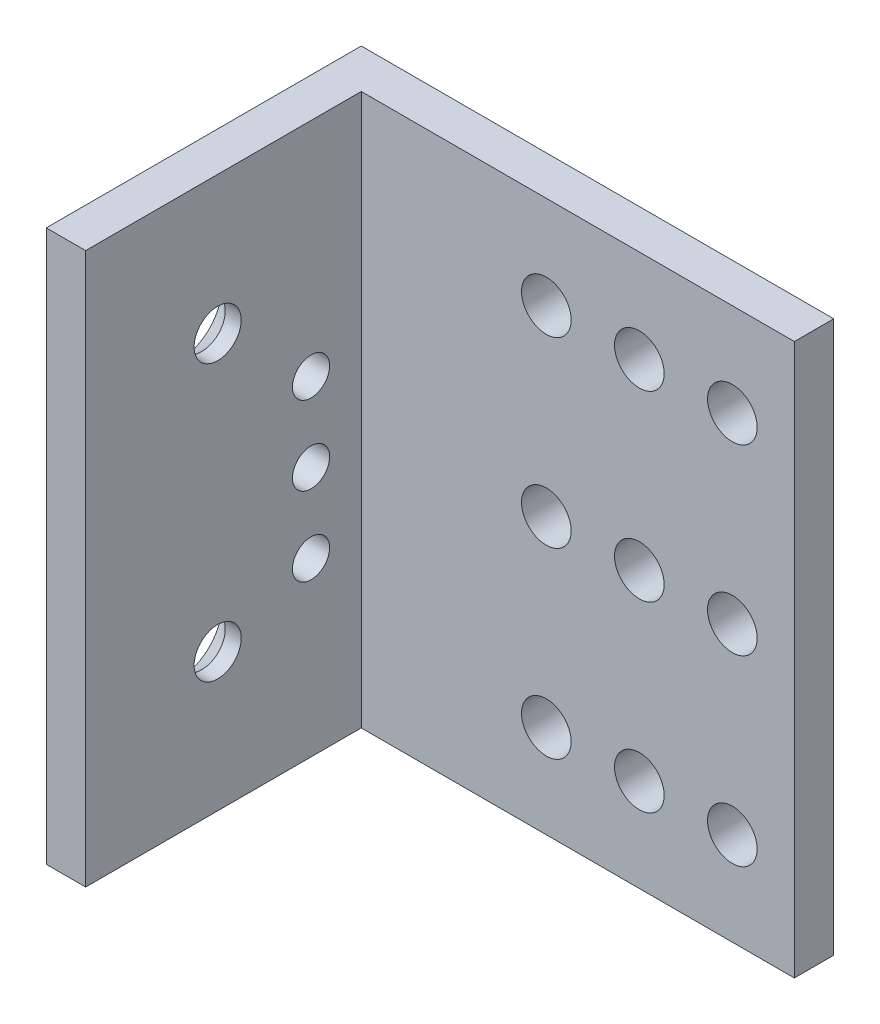
ISO-10303-21;
HEADER;
FILE_DESCRIPTION(('STEP AP214'),'2;1');
FILE_NAME('part.step','',(''),(''),'','','');
FILE_SCHEMA(('AUTOMOTIVE_DESIGN { 1 0 10303 214 1 1 1 1 }'));
ENDSEC;
DATA;
#1=APPLICATION_CONTEXT('core data for automotive mechanical design processes');
#2=APPLICATION_PROTOCOL_DEFINITION('international standard','automotive_design',2000,#1);
#3=PRODUCT_CONTEXT('',#1,'mechanical');
#4=PRODUCT('Part','Part','',(#3));
#5=PRODUCT_RELATED_PRODUCT_CATEGORY('part','',(#4));
#6=PRODUCT_DEFINITION_FORMATION('','',#4);
#7=PRODUCT_DEFINITION_CONTEXT('part definition',#1,'design');
#8=PRODUCT_DEFINITION('design','',#6,#7);
#9=PRODUCT_DEFINITION_SHAPE('','',#8);
#10=(LENGTH_UNIT() NAMED_UNIT(*) SI_UNIT(.MILLI.,.METRE.));
#11=(NAMED_UNIT(*) PLANE_ANGLE_UNIT() SI_UNIT($,.RADIAN.));
#12=(NAMED_UNIT(*) SI_UNIT($,.STERADIAN.) SOLID_ANGLE_UNIT());
#13=UNCERTAINTY_MEASURE_WITH_UNIT(LENGTH_MEASURE(1.E-05),#10,'distance_accuracy_value','');
#14=(GEOMETRIC_REPRESENTATION_CONTEXT(3) GLOBAL_UNCERTAINTY_ASSIGNED_CONTEXT((#13)) GLOBAL_UNIT_ASSIGNED_CONTEXT((#10,
#11,#12)) REPRESENTATION_CONTEXT('',''));
#15=CARTESIAN_POINT('',(0.,0.,0.));
#16=DIRECTION('',(0.,0.,1.));
#17=DIRECTION('',(1.,0.,0.));
#18=AXIS2_PLACEMENT_3D('',#15,#16,#17);
#19=CARTESIAN_POINT('',(19.05,22.225,-9.525));
#20=DIRECTION('',(-1.,0.,0.));
#21=DIRECTION('',(0.,0.,1.));
#22=AXIS2_PLACEMENT_3D('',#19,#20,#21);
#23=PLANE('',#22);
#24=DIRECTION('',(0.,0.,-1.));
#25=VECTOR('',#24,1.);
#26=CARTESIAN_POINT('',(19.05,-22.225,-9.525));
#27=LINE('',#26,#25);
#28=CARTESIAN_POINT('',(19.05,-22.225,-9.525));
#29=VERTEX_POINT('',#28);
#30=CARTESIAN_POINT('',(19.05,-22.225,-12.7));
#31=VERTEX_POINT('',#30);
#32=EDGE_CURVE('E129',#29,#31,#27,.T.);
#33=ORIENTED_EDGE('',*,*,#32,.T.);
#34=DIRECTION('',(0.,-1.,0.));
#35=VECTOR('',#34,1.);
#36=CARTESIAN_POINT('',(19.05,22.225,-12.7));
#37=LINE('',#36,#35);
#38=CARTESIAN_POINT('',(19.05,22.225,-12.7));
#39=VERTEX_POINT('',#38);
#40=EDGE_CURVE('E11',#39,#31,#37,.T.);
#41=ORIENTED_EDGE('',*,*,#40,.F.);
#42=DIRECTION('',(0.,0.,-1.));
#43=VECTOR('',#42,1.);
#44=CARTESIAN_POINT('',(19.05,22.225,-9.525));
#45=LINE('',#44,#43);
#46=CARTESIAN_POINT('',(19.05,22.225,-9.525));
#47=VERTEX_POINT('',#46);
#48=EDGE_CURVE('E146',#47,#39,#45,.T.);
#49=ORIENTED_EDGE('',*,*,#48,.F.);
#50=DIRECTION('',(0.,-1.,0.));
#51=VECTOR('',#50,1.);
#52=CARTESIAN_POINT('',(19.05,22.225,-9.525));
#53=LINE('',#52,#51);
#54=EDGE_CURVE('E125',#47,#29,#53,.T.);
#55=ORIENTED_EDGE('',*,*,#54,.T.);
#56=EDGE_LOOP('',(#33,#41,#49,#55));
#57=FACE_BOUND('',#56,.T.);
#58=ADVANCED_FACE('F38',(#57),#23,.F.);
#59=CARTESIAN_POINT('',(-19.05,22.225,-12.7));
#60=DIRECTION('',(0.,0.,1.));
#61=DIRECTION('',(1.,0.,0.));
#62=AXIS2_PLACEMENT_3D('',#59,#60,#61);
#63=PLANE('',#62);
#64=CARTESIAN_POINT('',(-0.95,-14.725,-12.7));
#65=DIRECTION('',(0.,0.,-1.));
#66=DIRECTION('',(-1.,0.,0.));
#67=AXIS2_PLACEMENT_3D('',#64,#65,#66);
#68=CIRCLE('',#67,2.);
#69=CARTESIAN_POINT('',(-2.95,-14.725,-12.7));
#70=VERTEX_POINT('',#69);
#71=EDGE_CURVE('E487',#70,#70,#68,.T.);
#72=ORIENTED_EDGE('',*,*,#71,.F.);
#73=EDGE_LOOP('',(#72));
#74=FACE_BOUND('',#73,.T.);
#75=CARTESIAN_POINT('',(6.55,-14.725,-12.7));
#76=DIRECTION('',(0.,0.,-1.));
#77=DIRECTION('',(-1.,0.,0.));
#78=AXIS2_PLACEMENT_3D('',#75,#76,#77);
#79=CIRCLE('',#78,2.);
#80=CARTESIAN_POINT('',(4.55,-14.725,-12.7));
#81=VERTEX_POINT('',#80);
#82=EDGE_CURVE('E491',#81,#81,#79,.T.);
#83=ORIENTED_EDGE('',*,*,#82,.F.);
#84=EDGE_LOOP('',(#83));
#85=FACE_BOUND('',#84,.T.);
#86=CARTESIAN_POINT('',(6.55,0.,-12.7));
#87=DIRECTION('',(0.,0.,-1.));
#88=DIRECTION('',(-1.,0.,0.));
#89=AXIS2_PLACEMENT_3D('',#86,#87,#88);
#90=CIRCLE('',#89,2.);
#91=CARTESIAN_POINT('',(4.55,0.,-12.7));
#92=VERTEX_POINT('',#91);
#93=EDGE_CURVE('E495',#92,#92,#90,.T.);
#94=ORIENTED_EDGE('',*,*,#93,.F.);
#95=EDGE_LOOP('',(#94));
#96=FACE_BOUND('',#95,.T.);
#97=CARTESIAN_POINT('',(6.55,14.725,-12.7));
#98=DIRECTION('',(0.,0.,-1.));
#99=DIRECTION('',(-1.,0.,0.));
#100=AXIS2_PLACEMENT_3D('',#97,#98,#99);
#101=CIRCLE('',#100,2.);
#102=CARTESIAN_POINT('',(4.55,14.725,-12.7));
#103=VERTEX_POINT('',#102);
#104=EDGE_CURVE('E474',#103,#103,#101,.T.);
#105=ORIENTED_EDGE('',*,*,#104,.F.);
#106=EDGE_LOOP('',(#105));
#107=FACE_BOUND('',#106,.T.);
#108=CARTESIAN_POINT('',(14.05,0.,-12.7));
#109=DIRECTION('',(0.,0.,-1.));
#110=DIRECTION('',(-1.,0.,0.));
#111=AXIS2_PLACEMENT_3D('',#108,#109,#110);
#112=CIRCLE('',#111,2.);
#113=CARTESIAN_POINT('',(12.05,0.,-12.7));
#114=VERTEX_POINT('',#113);
#115=EDGE_CURVE('E470',#114,#114,#112,.T.);
#116=ORIENTED_EDGE('',*,*,#115,.F.);
#117=EDGE_LOOP('',(#116));
#118=FACE_BOUND('',#117,.T.);
#119=CARTESIAN_POINT('',(14.05,14.725,-12.7));
#120=DIRECTION('',(0.,0.,-1.));
#121=DIRECTION('',(-1.,0.,0.));
#122=AXIS2_PLACEMENT_3D('',#119,#120,#121);
#123=CIRCLE('',#122,2.);
#124=CARTESIAN_POINT('',(12.05,14.725,-12.7));
#125=VERTEX_POINT('',#124);
#126=EDGE_CURVE('E475',#125,#125,#123,.T.);
#127=ORIENTED_EDGE('',*,*,#126,.F.);
#128=EDGE_LOOP('',(#127));
#129=FACE_BOUND('',#128,.T.);
#130=CARTESIAN_POINT('',(-0.95,0.,-12.7));
#131=DIRECTION('',(0.,0.,-1.));
#132=DIRECTION('',(-1.,0.,0.));
#133=AXIS2_PLACEMENT_3D('',#130,#131,#132);
#134=CIRCLE('',#133,2.);
#135=CARTESIAN_POINT('',(-2.95,0.,-12.7));
#136=VERTEX_POINT('',#135);
#137=EDGE_CURVE('E479',#136,#136,#134,.T.);
#138=ORIENTED_EDGE('',*,*,#137,.F.);
#139=EDGE_LOOP('',(#138));
#140=FACE_BOUND('',#139,.T.);
#141=CARTESIAN_POINT('',(-0.95,14.725,-12.7));
#142=DIRECTION('',(0.,0.,-1.));
#143=DIRECTION('',(-1.,0.,0.));
#144=AXIS2_PLACEMENT_3D('',#141,#142,#143);
#145=CIRCLE('',#144,2.);
#146=CARTESIAN_POINT('',(-2.95,14.725,-12.7));
#147=VERTEX_POINT('',#146);
#148=EDGE_CURVE('E483',#147,#147,#145,.T.);
#149=ORIENTED_EDGE('',*,*,#148,.F.);
#150=EDGE_LOOP('',(#149));
#151=FACE_BOUND('',#150,.T.);
#152=CARTESIAN_POINT('',(14.05,-14.725,-12.7));
#153=DIRECTION('',(0.,0.,-1.));
#154=DIRECTION('',(-1.,0.,0.));
#155=AXIS2_PLACEMENT_3D('',#152,#153,#154);
#156=CIRCLE('',#155,2.);
#157=CARTESIAN_POINT('',(12.05,-14.725,-12.7));
#158=VERTEX_POINT('',#157);
#159=EDGE_CURVE('E165',#158,#158,#156,.T.);
#160=ORIENTED_EDGE('',*,*,#159,.F.);
#161=EDGE_LOOP('',(#160));
#162=FACE_BOUND('',#161,.T.);
#163=DIRECTION('',(-1.,0.,0.));
#164=VECTOR('',#163,1.);
#165=CARTESIAN_POINT('',(-19.05,-22.225,-12.7));
#166=LINE('',#165,#164);
#167=CARTESIAN_POINT('',(-19.05,-22.225,-12.7));
#168=VERTEX_POINT('',#167);
#169=EDGE_CURVE('E133',#31,#168,#166,.T.);
#170=ORIENTED_EDGE('',*,*,#169,.T.);
#171=DIRECTION('',(0.,-1.,0.));
#172=VECTOR('',#171,1.);
#173=CARTESIAN_POINT('',(-19.05,22.225,-12.7));
#174=LINE('',#173,#172);
#175=CARTESIAN_POINT('',(-19.05,22.225,-12.7));
#176=VERTEX_POINT('',#175);
#177=EDGE_CURVE('E48',#176,#168,#174,.T.);
#178=ORIENTED_EDGE('',*,*,#177,.F.);
#179=DIRECTION('',(-1.,0.,0.));
#180=VECTOR('',#179,1.);
#181=CARTESIAN_POINT('',(-19.05,22.225,-12.7));
#182=LINE('',#181,#180);
#183=EDGE_CURVE('E94',#39,#176,#182,.T.);
#184=ORIENTED_EDGE('',*,*,#183,.F.);
#185=ORIENTED_EDGE('',*,*,#40,.T.);
#186=EDGE_LOOP('',(#170,#178,#184,#185));
#187=FACE_BOUND('',#186,.T.);
#188=ADVANCED_FACE('F215',(#74,#85,#96,#107,#118,#129,#140,#151,#162,#187),#63,.F.);
#189=CARTESIAN_POINT('',(-19.05,22.225,12.7));
#190=DIRECTION('',(1.,0.,0.));
#191=DIRECTION('',(0.,0.,-1.));
#192=AXIS2_PLACEMENT_3D('',#189,#190,#191);
#193=PLANE('',#192);
#194=CARTESIAN_POINT('',(-19.05,4.35,-5.475));
#195=DIRECTION('',(1.,0.,0.));
#196=DIRECTION('',(0.,0.,-1.));
#197=AXIS2_PLACEMENT_3D('',#194,#195,#196);
#198=CIRCLE('',#197,1.5);
#199=CARTESIAN_POINT('',(-19.05,4.35,-6.975));
#200=VERTEX_POINT('',#199);
#201=EDGE_CURVE('E442',#200,#200,#198,.T.);
#202=ORIENTED_EDGE('',*,*,#201,.T.);
#203=EDGE_LOOP('',(#202));
#204=FACE_BOUND('',#203,.T.);
#205=CARTESIAN_POINT('',(-19.05,-8.35,-5.475));
#206=DIRECTION('',(1.,0.,0.));
#207=DIRECTION('',(0.,0.,-1.));
#208=AXIS2_PLACEMENT_3D('',#205,#206,#207);
#209=CIRCLE('',#208,1.5);
#210=CARTESIAN_POINT('',(-19.05,-8.35,-6.975));
#211=VERTEX_POINT('',#210);
#212=EDGE_CURVE('E462',#211,#211,#209,.T.);
#213=ORIENTED_EDGE('',*,*,#212,.T.);
#214=EDGE_LOOP('',(#213));
#215=FACE_BOUND('',#214,.T.);
#216=CARTESIAN_POINT('',(-19.05,-2.,-5.475));
#217=DIRECTION('',(1.,0.,0.));
#218=DIRECTION('',(0.,0.,-1.));
#219=AXIS2_PLACEMENT_3D('',#216,#217,#218);
#220=CIRCLE('',#219,1.5);
#221=CARTESIAN_POINT('',(-19.05,-2.,-6.975));
#222=VERTEX_POINT('',#221);
#223=EDGE_CURVE('E453',#222,#222,#220,.T.);
#224=ORIENTED_EDGE('',*,*,#223,.T.);
#225=EDGE_LOOP('',(#224));
#226=FACE_BOUND('',#225,.T.);
#227=CARTESIAN_POINT('',(-19.05,-11.1125,2.05500000000001));
#228=DIRECTION('',(-1.,0.,0.));
#229=DIRECTION('',(0.,0.,1.));
#230=AXIS2_PLACEMENT_3D('',#227,#228,#229);
#231=CIRCLE('',#230,3.5433);
#232=CARTESIAN_POINT('',(-19.05,-11.1125,5.59830000000001));
#233=VERTEX_POINT('',#232);
#234=EDGE_CURVE('E457',#233,#233,#231,.T.);
#235=ORIENTED_EDGE('',*,*,#234,.F.);
#236=EDGE_LOOP('',(#235));
#237=FACE_BOUND('',#236,.T.);
#238=CARTESIAN_POINT('',(-19.05,11.1125,2.05500000000001));
#239=DIRECTION('',(-1.,0.,0.));
#240=DIRECTION('',(0.,0.,1.));
#241=AXIS2_PLACEMENT_3D('',#238,#239,#240);
#242=CIRCLE('',#241,3.5433);
#243=CARTESIAN_POINT('',(-19.05,11.1125,5.59830000000001));
#244=VERTEX_POINT('',#243);
#245=EDGE_CURVE('E195',#244,#244,#242,.T.);
#246=ORIENTED_EDGE('',*,*,#245,.F.);
#247=EDGE_LOOP('',(#246));
#248=FACE_BOUND('',#247,.T.);
#249=DIRECTION('',(0.,0.,1.));
#250=VECTOR('',#249,1.);
#251=CARTESIAN_POINT('',(-19.05,-22.225,12.7));
#252=LINE('',#251,#250);
#253=CARTESIAN_POINT('',(-19.05,-22.225,12.7));
#254=VERTEX_POINT('',#253);
#255=EDGE_CURVE('E137',#168,#254,#252,.T.);
#256=ORIENTED_EDGE('',*,*,#255,.T.);
#257=DIRECTION('',(0.,-1.,0.));
#258=VECTOR('',#257,1.);
#259=CARTESIAN_POINT('',(-19.05,22.225,12.7));
#260=LINE('',#259,#258);
#261=CARTESIAN_POINT('',(-19.05,22.225,12.7));
#262=VERTEX_POINT('',#261);
#263=EDGE_CURVE('E118',#262,#254,#260,.T.);
#264=ORIENTED_EDGE('',*,*,#263,.F.);
#265=DIRECTION('',(0.,0.,1.));
#266=VECTOR('',#265,1.);
#267=CARTESIAN_POINT('',(-19.05,22.225,12.7));
#268=LINE('',#267,#266);
#269=EDGE_CURVE('E107',#176,#262,#268,.T.);
#270=ORIENTED_EDGE('',*,*,#269,.F.);
#271=ORIENTED_EDGE('',*,*,#177,.T.);
#272=EDGE_LOOP('',(#256,#264,#270,#271));
#273=FACE_BOUND('',#272,.T.);
#274=ADVANCED_FACE('F218',(#204,#215,#226,#237,#248,#273),#193,.F.);
#275=CARTESIAN_POINT('',(-19.05,22.225,12.7));
#276=DIRECTION('',(0.,0.,-1.));
#277=DIRECTION('',(-1.,0.,0.));
#278=AXIS2_PLACEMENT_3D('',#275,#276,#277);
#279=PLANE('',#278);
#280=DIRECTION('',(1.,0.,0.));
#281=VECTOR('',#280,1.);
#282=CARTESIAN_POINT('',(-19.05,-22.225,12.7));
#283=LINE('',#282,#281);
#284=CARTESIAN_POINT('',(-15.875,-22.225,12.7));
#285=VERTEX_POINT('',#284);
#286=EDGE_CURVE('E116',#254,#285,#283,.T.);
#287=ORIENTED_EDGE('',*,*,#286,.T.);
#288=DIRECTION('',(0.,-1.,0.));
#289=VECTOR('',#288,1.);
#290=CARTESIAN_POINT('',(-15.875,22.225,12.7));
#291=LINE('',#290,#289);
#292=CARTESIAN_POINT('',(-15.875,22.225,12.7));
#293=VERTEX_POINT('',#292);
#294=EDGE_CURVE('E113',#293,#285,#291,.T.);
#295=ORIENTED_EDGE('',*,*,#294,.F.);
#296=DIRECTION('',(1.,0.,0.));
#297=VECTOR('',#296,1.);
#298=CARTESIAN_POINT('',(-19.05,22.225,12.7));
#299=LINE('',#298,#297);
#300=EDGE_CURVE('E101',#262,#293,#299,.T.);
#301=ORIENTED_EDGE('',*,*,#300,.F.);
#302=ORIENTED_EDGE('',*,*,#263,.T.);
#303=EDGE_LOOP('',(#287,#295,#301,#302));
#304=FACE_BOUND('',#303,.T.);
#305=ADVANCED_FACE('F114',(#304),#279,.F.);
#306=CARTESIAN_POINT('',(-15.875,22.225,12.7));
#307=DIRECTION('',(-1.,0.,0.));
#308=DIRECTION('',(0.,0.,1.));
#309=AXIS2_PLACEMENT_3D('',#306,#307,#308);
#310=PLANE('',#309);
#311=CARTESIAN_POINT('',(-15.875,4.35,-5.475));
#312=DIRECTION('',(1.,0.,0.));
#313=DIRECTION('',(0.,0.,-1.));
#314=AXIS2_PLACEMENT_3D('',#311,#312,#313);
#315=CIRCLE('',#314,1.5);
#316=CARTESIAN_POINT('',(-15.875,4.35,-6.975));
#317=VERTEX_POINT('',#316);
#318=EDGE_CURVE('E445',#317,#317,#315,.T.);
#319=ORIENTED_EDGE('',*,*,#318,.F.);
#320=EDGE_LOOP('',(#319));
#321=FACE_BOUND('',#320,.T.);
#322=CARTESIAN_POINT('',(-15.875,-8.35,-5.475));
#323=DIRECTION('',(1.,0.,0.));
#324=DIRECTION('',(0.,0.,-1.));
#325=AXIS2_PLACEMENT_3D('',#322,#323,#324);
#326=CIRCLE('',#325,1.5);
#327=CARTESIAN_POINT('',(-15.875,-8.35,-6.975));
#328=VERTEX_POINT('',#327);
#329=EDGE_CURVE('E449',#328,#328,#326,.T.);
#330=ORIENTED_EDGE('',*,*,#329,.F.);
#331=EDGE_LOOP('',(#330));
#332=FACE_BOUND('',#331,.T.);
#333=CARTESIAN_POINT('',(-15.875,-2.,-5.475));
#334=DIRECTION('',(1.,0.,0.));
#335=DIRECTION('',(0.,0.,-1.));
#336=AXIS2_PLACEMENT_3D('',#333,#334,#335);
#337=CIRCLE('',#336,1.5);
#338=CARTESIAN_POINT('',(-15.875,-2.,-6.975));
#339=VERTEX_POINT('',#338);
#340=EDGE_CURVE('E458',#339,#339,#337,.T.);
#341=ORIENTED_EDGE('',*,*,#340,.F.);
#342=EDGE_LOOP('',(#341));
#343=FACE_BOUND('',#342,.T.);
#344=CARTESIAN_POINT('',(-15.875,-11.1125,2.05500000000001));
#345=DIRECTION('',(-1.,0.,0.));
#346=DIRECTION('',(0.,0.,1.));
#347=AXIS2_PLACEMENT_3D('',#344,#345,#346);
#348=CIRCLE('',#347,1.89864999999999);
#349=CARTESIAN_POINT('',(-15.875,-11.1125,3.95365));
#350=VERTEX_POINT('',#349);
#351=EDGE_CURVE('E41',#350,#350,#348,.T.);
#352=ORIENTED_EDGE('',*,*,#351,.T.);
#353=EDGE_LOOP('',(#352));
#354=FACE_BOUND('',#353,.T.);
#355=CARTESIAN_POINT('',(-15.875,11.1125,2.05500000000001));
#356=DIRECTION('',(-1.,0.,0.));
#357=DIRECTION('',(0.,0.,1.));
#358=AXIS2_PLACEMENT_3D('',#355,#356,#357);
#359=CIRCLE('',#358,1.89864999999999);
#360=CARTESIAN_POINT('',(-15.875,11.1125,3.95365));
#361=VERTEX_POINT('',#360);
#362=EDGE_CURVE('E134',#361,#361,#359,.T.);
#363=ORIENTED_EDGE('',*,*,#362,.T.);
#364=EDGE_LOOP('',(#363));
#365=FACE_BOUND('',#364,.T.);
#366=DIRECTION('',(0.,0.,-1.));
#367=VECTOR('',#366,1.);
#368=CARTESIAN_POINT('',(-15.875,-22.225,12.7));
#369=LINE('',#368,#367);
#370=CARTESIAN_POINT('',(-15.875,-22.225,-9.525));
#371=VERTEX_POINT('',#370);
#372=EDGE_CURVE('E80',#285,#371,#369,.T.);
#373=ORIENTED_EDGE('',*,*,#372,.T.);
#374=DIRECTION('',(0.,-1.,0.));
#375=VECTOR('',#374,1.);
#376=CARTESIAN_POINT('',(-15.875,22.225,-9.525));
#377=LINE('',#376,#375);
#378=CARTESIAN_POINT('',(-15.875,22.225,-9.525));
#379=VERTEX_POINT('',#378);
#380=EDGE_CURVE('E119',#379,#371,#377,.T.);
#381=ORIENTED_EDGE('',*,*,#380,.F.);
#382=DIRECTION('',(0.,0.,-1.));
#383=VECTOR('',#382,1.);
#384=CARTESIAN_POINT('',(-15.875,22.225,12.7));
#385=LINE('',#384,#383);
#386=EDGE_CURVE('E105',#293,#379,#385,.T.);
#387=ORIENTED_EDGE('',*,*,#386,.F.);
#388=ORIENTED_EDGE('',*,*,#294,.T.);
#389=EDGE_LOOP('',(#373,#381,#387,#388));
#390=FACE_BOUND('',#389,.T.);
#391=ADVANCED_FACE('F121',(#321,#332,#343,#354,#365,#390),#310,.F.);
#392=CARTESIAN_POINT('',(-15.875,22.225,-9.525));
#393=DIRECTION('',(0.,0.,-1.));
#394=DIRECTION('',(-1.,0.,0.));
#395=AXIS2_PLACEMENT_3D('',#392,#393,#394);
#396=PLANE('',#395);
#397=CARTESIAN_POINT('',(-0.95,-14.725,-9.52499999999999));
#398=DIRECTION('',(0.,0.,-1.));
#399=DIRECTION('',(-1.,0.,0.));
#400=AXIS2_PLACEMENT_3D('',#397,#398,#399);
#401=CIRCLE('',#400,2.);
#402=CARTESIAN_POINT('',(-2.95,-14.725,-9.52499999999999));
#403=VERTEX_POINT('',#402);
#404=EDGE_CURVE('E192',#403,#403,#401,.T.);
#405=ORIENTED_EDGE('',*,*,#404,.T.);
#406=EDGE_LOOP('',(#405));
#407=FACE_BOUND('',#406,.T.);
#408=CARTESIAN_POINT('',(6.55,-14.725,-9.52499999999999));
#409=DIRECTION('',(0.,0.,-1.));
#410=DIRECTION('',(-1.,0.,0.));
#411=AXIS2_PLACEMENT_3D('',#408,#409,#410);
#412=CIRCLE('',#411,2.);
#413=CARTESIAN_POINT('',(4.55,-14.725,-9.52499999999999));
#414=VERTEX_POINT('',#413);
#415=EDGE_CURVE('E189',#414,#414,#412,.T.);
#416=ORIENTED_EDGE('',*,*,#415,.T.);
#417=EDGE_LOOP('',(#416));
#418=FACE_BOUND('',#417,.T.);
#419=CARTESIAN_POINT('',(6.55,0.,-9.52499999999999));
#420=DIRECTION('',(0.,0.,-1.));
#421=DIRECTION('',(-1.,0.,0.));
#422=AXIS2_PLACEMENT_3D('',#419,#420,#421);
#423=CIRCLE('',#422,2.);
#424=CARTESIAN_POINT('',(4.55,0.,-9.52499999999999));
#425=VERTEX_POINT('',#424);
#426=EDGE_CURVE('E185',#425,#425,#423,.T.);
#427=ORIENTED_EDGE('',*,*,#426,.T.);
#428=EDGE_LOOP('',(#427));
#429=FACE_BOUND('',#428,.T.);
#430=CARTESIAN_POINT('',(6.55,14.725,-9.52499999999999));
#431=DIRECTION('',(0.,0.,-1.));
#432=DIRECTION('',(-1.,0.,0.));
#433=AXIS2_PLACEMENT_3D('',#430,#431,#432);
#434=CIRCLE('',#433,2.);
#435=CARTESIAN_POINT('',(4.55,14.725,-9.52499999999999));
#436=VERTEX_POINT('',#435);
#437=EDGE_CURVE('E181',#436,#436,#434,.T.);
#438=ORIENTED_EDGE('',*,*,#437,.T.);
#439=EDGE_LOOP('',(#438));
#440=FACE_BOUND('',#439,.T.);
#441=CARTESIAN_POINT('',(14.05,0.,-9.52499999999999));
#442=DIRECTION('',(0.,0.,-1.));
#443=DIRECTION('',(-1.,0.,0.));
#444=AXIS2_PLACEMENT_3D('',#441,#442,#443);
#445=CIRCLE('',#444,2.);
#446=CARTESIAN_POINT('',(12.05,0.,-9.52499999999999));
#447=VERTEX_POINT('',#446);
#448=EDGE_CURVE('E177',#447,#447,#445,.T.);
#449=ORIENTED_EDGE('',*,*,#448,.T.);
#450=EDGE_LOOP('',(#449));
#451=FACE_BOUND('',#450,.T.);
#452=CARTESIAN_POINT('',(14.05,14.725,-9.52499999999999));
#453=DIRECTION('',(0.,0.,-1.));
#454=DIRECTION('',(-1.,0.,0.));
#455=AXIS2_PLACEMENT_3D('',#452,#453,#454);
#456=CIRCLE('',#455,2.);
#457=CARTESIAN_POINT('',(12.05,14.725,-9.52499999999999));
#458=VERTEX_POINT('',#457);
#459=EDGE_CURVE('E173',#458,#458,#456,.T.);
#460=ORIENTED_EDGE('',*,*,#459,.T.);
#461=EDGE_LOOP('',(#460));
#462=FACE_BOUND('',#461,.T.);
#463=CARTESIAN_POINT('',(-0.95,0.,-9.52499999999999));
#464=DIRECTION('',(0.,0.,-1.));
#465=DIRECTION('',(-1.,0.,0.));
#466=AXIS2_PLACEMENT_3D('',#463,#464,#465);
#467=CIRCLE('',#466,2.);
#468=CARTESIAN_POINT('',(-2.95,0.,-9.52499999999999));
#469=VERTEX_POINT('',#468);
#470=EDGE_CURVE('E169',#469,#469,#467,.T.);
#471=ORIENTED_EDGE('',*,*,#470,.T.);
#472=EDGE_LOOP('',(#471));
#473=FACE_BOUND('',#472,.T.);
#474=CARTESIAN_POINT('',(-0.95,14.725,-9.52499999999999));
#475=DIRECTION('',(0.,0.,-1.));
#476=DIRECTION('',(-1.,0.,0.));
#477=AXIS2_PLACEMENT_3D('',#474,#475,#476);
#478=CIRCLE('',#477,2.);
#479=CARTESIAN_POINT('',(-2.95,14.725,-9.52499999999999));
#480=VERTEX_POINT('',#479);
#481=EDGE_CURVE('E164',#480,#480,#478,.T.);
#482=ORIENTED_EDGE('',*,*,#481,.T.);
#483=EDGE_LOOP('',(#482));
#484=FACE_BOUND('',#483,.T.);
#485=CARTESIAN_POINT('',(14.05,-14.725,-9.52499999999999));
#486=DIRECTION('',(0.,0.,-1.));
#487=DIRECTION('',(-1.,0.,0.));
#488=AXIS2_PLACEMENT_3D('',#485,#486,#487);
#489=CIRCLE('',#488,2.);
#490=CARTESIAN_POINT('',(12.05,-14.725,-9.52499999999999));
#491=VERTEX_POINT('',#490);
#492=EDGE_CURVE('E160',#491,#491,#489,.T.);
#493=ORIENTED_EDGE('',*,*,#492,.T.);
#494=EDGE_LOOP('',(#493));
#495=FACE_BOUND('',#494,.T.);
#496=DIRECTION('',(1.,0.,0.));
#497=VECTOR('',#496,1.);
#498=CARTESIAN_POINT('',(-15.875,-22.225,-9.525));
#499=LINE('',#498,#497);
#500=EDGE_CURVE('E86',#371,#29,#499,.T.);
#501=ORIENTED_EDGE('',*,*,#500,.T.);
#502=ORIENTED_EDGE('',*,*,#54,.F.);
#503=DIRECTION('',(1.,0.,0.));
#504=VECTOR('',#503,1.);
#505=CARTESIAN_POINT('',(-15.875,22.225,-9.525));
#506=LINE('',#505,#504);
#507=EDGE_CURVE('E57',#379,#47,#506,.T.);
#508=ORIENTED_EDGE('',*,*,#507,.F.);
#509=ORIENTED_EDGE('',*,*,#380,.T.);
#510=EDGE_LOOP('',(#501,#502,#508,#509));
#511=FACE_BOUND('',#510,.T.);
#512=ADVANCED_FACE('F223',(#407,#418,#429,#440,#451,#462,#473,#484,#495,#511),#396,.F.);
#513=CARTESIAN_POINT('',(0.,22.225,0.));
#514=DIRECTION('',(0.,-1.,0.));
#515=DIRECTION('',(0.,0.,-1.));
#516=AXIS2_PLACEMENT_3D('',#513,#514,#515);
#517=PLANE('',#516);
#518=ORIENTED_EDGE('',*,*,#48,.T.);
#519=ORIENTED_EDGE('',*,*,#183,.T.);
#520=ORIENTED_EDGE('',*,*,#269,.T.);
#521=ORIENTED_EDGE('',*,*,#300,.T.);
#522=ORIENTED_EDGE('',*,*,#386,.T.);
#523=ORIENTED_EDGE('',*,*,#507,.T.);
#524=EDGE_LOOP('',(#518,#519,#520,#521,#522,#523));
#525=FACE_BOUND('',#524,.T.);
#526=ADVANCED_FACE('F103',(#525),#517,.F.);
#527=CARTESIAN_POINT('',(0.,-22.225,0.));
#528=DIRECTION('',(0.,-1.,0.));
#529=DIRECTION('',(0.,0.,-1.));
#530=AXIS2_PLACEMENT_3D('',#527,#528,#529);
#531=PLANE('',#530);
#532=ORIENTED_EDGE('',*,*,#32,.F.);
#533=ORIENTED_EDGE('',*,*,#500,.F.);
#534=ORIENTED_EDGE('',*,*,#372,.F.);
#535=ORIENTED_EDGE('',*,*,#286,.F.);
#536=ORIENTED_EDGE('',*,*,#255,.F.);
#537=ORIENTED_EDGE('',*,*,#169,.F.);
#538=EDGE_LOOP('',(#532,#533,#534,#535,#536,#537));
#539=FACE_BOUND('',#538,.T.);
#540=ADVANCED_FACE('F221',(#539),#531,.T.);
#541=CARTESIAN_POINT('',(-19.05,11.1125,2.05500000000001));
#542=DIRECTION('',(-1.,0.,0.));
#543=DIRECTION('',(0.,0.,1.));
#544=AXIS2_PLACEMENT_3D('',#541,#542,#543);
#545=CYLINDRICAL_SURFACE('',#544,1.89864999999999);
#546=CARTESIAN_POINT('',(-17.158046599064,11.1125,2.05500000000001));
#547=DIRECTION('',(-1.,0.,0.));
#548=DIRECTION('',(0.,0.,1.));
#549=AXIS2_PLACEMENT_3D('',#546,#547,#548);
#550=CIRCLE('',#549,1.89864999999999);
#551=CARTESIAN_POINT('',(-17.158046599064,11.1125,3.95365));
#552=VERTEX_POINT('',#551);
#553=EDGE_CURVE('E159',#552,#552,#550,.T.);
#554=ORIENTED_EDGE('',*,*,#553,.T.);
#555=EDGE_LOOP('',(#554));
#556=FACE_BOUND('',#555,.T.);
#557=ORIENTED_EDGE('',*,*,#362,.F.);
#558=EDGE_LOOP('',(#557));
#559=FACE_BOUND('',#558,.T.);
#560=ADVANCED_FACE('F277',(#556,#559),#545,.F.);
#561=CARTESIAN_POINT('',(-19.05,11.1125,2.05500000000001));
#562=DIRECTION('',(-1.,0.,0.));
#563=DIRECTION('',(0.,0.,1.));
#564=AXIS2_PLACEMENT_3D('',#561,#562,#563);
#565=CONICAL_SURFACE('',#564,3.5433,0.715584993317676);
#566=ORIENTED_EDGE('',*,*,#553,.F.);
#567=EDGE_LOOP('',(#566));
#568=FACE_BOUND('',#567,.T.);
#569=ORIENTED_EDGE('',*,*,#245,.T.);
#570=EDGE_LOOP('',(#569));
#571=FACE_BOUND('',#570,.T.);
#572=ADVANCED_FACE('F283',(#568,#571),#565,.F.);
#573=CARTESIAN_POINT('',(14.05,-14.725,12.7));
#574=DIRECTION('',(0.,0.,-1.));
#575=DIRECTION('',(-1.,0.,0.));
#576=AXIS2_PLACEMENT_3D('',#573,#574,#575);
#577=CYLINDRICAL_SURFACE('',#576,2.);
#578=ORIENTED_EDGE('',*,*,#159,.T.);
#579=EDGE_LOOP('',(#578));
#580=FACE_BOUND('',#579,.T.);
#581=ORIENTED_EDGE('',*,*,#492,.F.);
#582=EDGE_LOOP('',(#581));
#583=FACE_BOUND('',#582,.T.);
#584=ADVANCED_FACE('F290',(#580,#583),#577,.F.);
#585=CARTESIAN_POINT('',(-0.95,14.725,12.7));
#586=DIRECTION('',(0.,0.,-1.));
#587=DIRECTION('',(-1.,0.,0.));
#588=AXIS2_PLACEMENT_3D('',#585,#586,#587);
#589=CYLINDRICAL_SURFACE('',#588,2.);
#590=ORIENTED_EDGE('',*,*,#148,.T.);
#591=EDGE_LOOP('',(#590));
#592=FACE_BOUND('',#591,.T.);
#593=ORIENTED_EDGE('',*,*,#481,.F.);
#594=EDGE_LOOP('',(#593));
#595=FACE_BOUND('',#594,.T.);
#596=ADVANCED_FACE('F297',(#592,#595),#589,.F.);
#597=CARTESIAN_POINT('',(-0.95,0.,12.7));
#598=DIRECTION('',(0.,0.,-1.));
#599=DIRECTION('',(-1.,0.,0.));
#600=AXIS2_PLACEMENT_3D('',#597,#598,#599);
#601=CYLINDRICAL_SURFACE('',#600,2.);
#602=ORIENTED_EDGE('',*,*,#137,.T.);
#603=EDGE_LOOP('',(#602));
#604=FACE_BOUND('',#603,.T.);
#605=ORIENTED_EDGE('',*,*,#470,.F.);
#606=EDGE_LOOP('',(#605));
#607=FACE_BOUND('',#606,.T.);
#608=ADVANCED_FACE('F305',(#604,#607),#601,.F.);
#609=CARTESIAN_POINT('',(14.05,14.725,12.7));
#610=DIRECTION('',(0.,0.,-1.));
#611=DIRECTION('',(-1.,0.,0.));
#612=AXIS2_PLACEMENT_3D('',#609,#610,#611);
#613=CYLINDRICAL_SURFACE('',#612,2.);
#614=ORIENTED_EDGE('',*,*,#126,.T.);
#615=EDGE_LOOP('',(#614));
#616=FACE_BOUND('',#615,.T.);
#617=ORIENTED_EDGE('',*,*,#459,.F.);
#618=EDGE_LOOP('',(#617));
#619=FACE_BOUND('',#618,.T.);
#620=ADVANCED_FACE('F313',(#616,#619),#613,.F.);
#621=CARTESIAN_POINT('',(14.05,0.,12.7));
#622=DIRECTION('',(0.,0.,-1.));
#623=DIRECTION('',(-1.,0.,0.));
#624=AXIS2_PLACEMENT_3D('',#621,#622,#623);
#625=CYLINDRICAL_SURFACE('',#624,2.);
#626=ORIENTED_EDGE('',*,*,#115,.T.);
#627=EDGE_LOOP('',(#626));
#628=FACE_BOUND('',#627,.T.);
#629=ORIENTED_EDGE('',*,*,#448,.F.);
#630=EDGE_LOOP('',(#629));
#631=FACE_BOUND('',#630,.T.);
#632=ADVANCED_FACE('F321',(#628,#631),#625,.F.);
#633=CARTESIAN_POINT('',(6.55,14.725,12.7));
#634=DIRECTION('',(0.,0.,-1.));
#635=DIRECTION('',(-1.,0.,0.));
#636=AXIS2_PLACEMENT_3D('',#633,#634,#635);
#637=CYLINDRICAL_SURFACE('',#636,2.);
#638=ORIENTED_EDGE('',*,*,#104,.T.);
#639=EDGE_LOOP('',(#638));
#640=FACE_BOUND('',#639,.T.);
#641=ORIENTED_EDGE('',*,*,#437,.F.);
#642=EDGE_LOOP('',(#641));
#643=FACE_BOUND('',#642,.T.);
#644=ADVANCED_FACE('F329',(#640,#643),#637,.F.);
#645=CARTESIAN_POINT('',(6.55,0.,12.7));
#646=DIRECTION('',(0.,0.,-1.));
#647=DIRECTION('',(-1.,0.,0.));
#648=AXIS2_PLACEMENT_3D('',#645,#646,#647);
#649=CYLINDRICAL_SURFACE('',#648,2.);
#650=ORIENTED_EDGE('',*,*,#93,.T.);
#651=EDGE_LOOP('',(#650));
#652=FACE_BOUND('',#651,.T.);
#653=ORIENTED_EDGE('',*,*,#426,.F.);
#654=EDGE_LOOP('',(#653));
#655=FACE_BOUND('',#654,.T.);
#656=ADVANCED_FACE('F337',(#652,#655),#649,.F.);
#657=CARTESIAN_POINT('',(6.55,-14.725,12.7));
#658=DIRECTION('',(0.,0.,-1.));
#659=DIRECTION('',(-1.,0.,0.));
#660=AXIS2_PLACEMENT_3D('',#657,#658,#659);
#661=CYLINDRICAL_SURFACE('',#660,2.);
#662=ORIENTED_EDGE('',*,*,#82,.T.);
#663=EDGE_LOOP('',(#662));
#664=FACE_BOUND('',#663,.T.);
#665=ORIENTED_EDGE('',*,*,#415,.F.);
#666=EDGE_LOOP('',(#665));
#667=FACE_BOUND('',#666,.T.);
#668=ADVANCED_FACE('F345',(#664,#667),#661,.F.);
#669=CARTESIAN_POINT('',(-0.95,-14.725,12.7));
#670=DIRECTION('',(0.,0.,-1.));
#671=DIRECTION('',(-1.,0.,0.));
#672=AXIS2_PLACEMENT_3D('',#669,#670,#671);
#673=CYLINDRICAL_SURFACE('',#672,2.);
#674=ORIENTED_EDGE('',*,*,#71,.T.);
#675=EDGE_LOOP('',(#674));
#676=FACE_BOUND('',#675,.T.);
#677=ORIENTED_EDGE('',*,*,#404,.F.);
#678=EDGE_LOOP('',(#677));
#679=FACE_BOUND('',#678,.T.);
#680=ADVANCED_FACE('F353',(#676,#679),#673,.F.);
#681=CARTESIAN_POINT('',(-19.05,-11.1125,2.05500000000001));
#682=DIRECTION('',(-1.,0.,0.));
#683=DIRECTION('',(0.,0.,1.));
#684=AXIS2_PLACEMENT_3D('',#681,#682,#683);
#685=CYLINDRICAL_SURFACE('',#684,1.89864999999999);
#686=CARTESIAN_POINT('',(-17.158046599064,-11.1125,2.05500000000001));
#687=DIRECTION('',(-1.,0.,0.));
#688=DIRECTION('',(0.,0.,1.));
#689=AXIS2_PLACEMENT_3D('',#686,#687,#688);
#690=CIRCLE('',#689,1.89864999999999);
#691=CARTESIAN_POINT('',(-17.158046599064,-11.1125,3.95365));
#692=VERTEX_POINT('',#691);
#693=EDGE_CURVE('E466',#692,#692,#690,.T.);
#694=ORIENTED_EDGE('',*,*,#693,.T.);
#695=EDGE_LOOP('',(#694));
#696=FACE_BOUND('',#695,.T.);
#697=ORIENTED_EDGE('',*,*,#351,.F.);
#698=EDGE_LOOP('',(#697));
#699=FACE_BOUND('',#698,.T.);
#700=ADVANCED_FACE('F361',(#696,#699),#685,.F.);
#701=CARTESIAN_POINT('',(-19.05,-11.1125,2.05500000000001));
#702=DIRECTION('',(-1.,0.,0.));
#703=DIRECTION('',(0.,0.,1.));
#704=AXIS2_PLACEMENT_3D('',#701,#702,#703);
#705=CONICAL_SURFACE('',#704,3.5433,0.715584993317676);
#706=ORIENTED_EDGE('',*,*,#693,.F.);
#707=EDGE_LOOP('',(#706));
#708=FACE_BOUND('',#707,.T.);
#709=ORIENTED_EDGE('',*,*,#234,.T.);
#710=EDGE_LOOP('',(#709));
#711=FACE_BOUND('',#710,.T.);
#712=ADVANCED_FACE('F369',(#708,#711),#705,.F.);
#713=CARTESIAN_POINT('',(-19.05,-2.,-5.475));
#714=DIRECTION('',(1.,0.,0.));
#715=DIRECTION('',(0.,0.,-1.));
#716=AXIS2_PLACEMENT_3D('',#713,#714,#715);
#717=CYLINDRICAL_SURFACE('',#716,1.5);
#718=ORIENTED_EDGE('',*,*,#223,.F.);
#719=EDGE_LOOP('',(#718));
#720=FACE_BOUND('',#719,.T.);
#721=ORIENTED_EDGE('',*,*,#340,.T.);
#722=EDGE_LOOP('',(#721));
#723=FACE_BOUND('',#722,.T.);
#724=ADVANCED_FACE('F377',(#720,#723),#717,.F.);
#725=CARTESIAN_POINT('',(-19.05,-8.35,-5.475));
#726=DIRECTION('',(1.,0.,0.));
#727=DIRECTION('',(0.,0.,-1.));
#728=AXIS2_PLACEMENT_3D('',#725,#726,#727);
#729=CYLINDRICAL_SURFACE('',#728,1.5);
#730=ORIENTED_EDGE('',*,*,#212,.F.);
#731=EDGE_LOOP('',(#730));
#732=FACE_BOUND('',#731,.T.);
#733=ORIENTED_EDGE('',*,*,#329,.T.);
#734=EDGE_LOOP('',(#733));
#735=FACE_BOUND('',#734,.T.);
#736=ADVANCED_FACE('F384',(#732,#735),#729,.F.);
#737=CARTESIAN_POINT('',(-19.05,4.35,-5.475));
#738=DIRECTION('',(1.,0.,0.));
#739=DIRECTION('',(0.,0.,-1.));
#740=AXIS2_PLACEMENT_3D('',#737,#738,#739);
#741=CYLINDRICAL_SURFACE('',#740,1.5);
#742=ORIENTED_EDGE('',*,*,#201,.F.);
#743=EDGE_LOOP('',(#742));
#744=FACE_BOUND('',#743,.T.);
#745=ORIENTED_EDGE('',*,*,#318,.T.);
#746=EDGE_LOOP('',(#745));
#747=FACE_BOUND('',#746,.T.);
#748=ADVANCED_FACE('F392',(#744,#747),#741,.F.);
#749=CLOSED_SHELL('',(#58,#188,#274,#305,#391,#512,#526,#540,#560,#572,#584,#596,#608,#620,#632,
#644,#656,#668,#680,#700,#712,#724,#736,#748));
#750=MANIFOLD_SOLID_BREP('B2',#749);
#751=ADVANCED_BREP_SHAPE_REPRESENTATION('',(#18,#750),#14);
#752=SHAPE_DEFINITION_REPRESENTATION(#9,#751);
ENDSEC;
END-ISO-10303-21;
